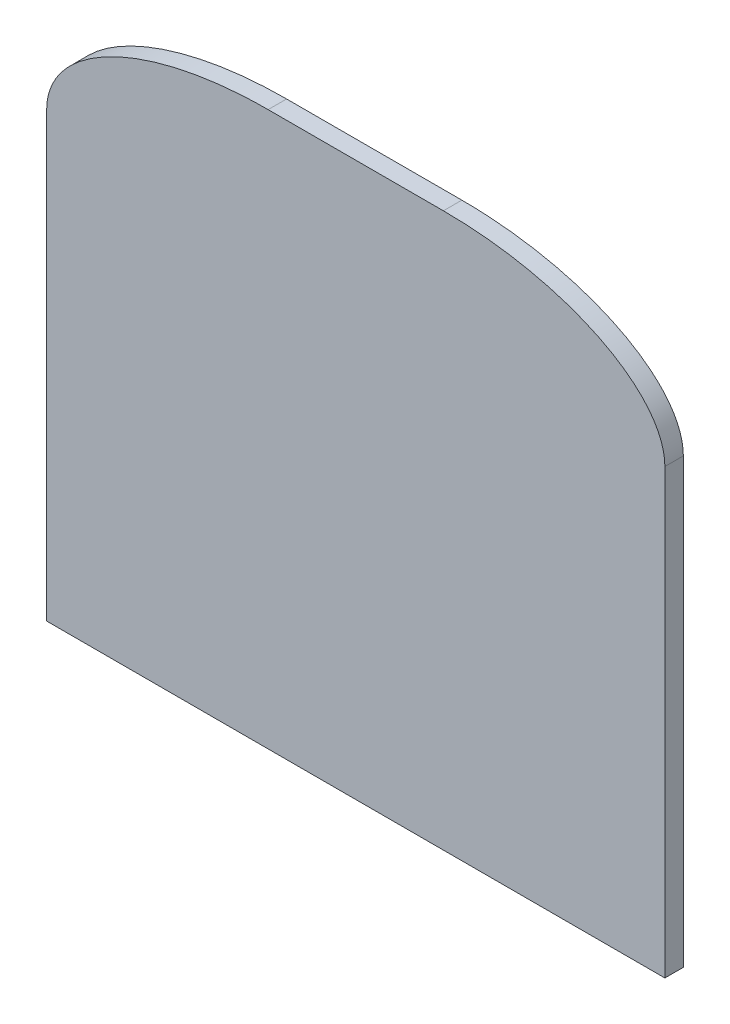
ISO-10303-21;
HEADER;
FILE_DESCRIPTION(('STEP AP214'),'2;1');
FILE_NAME('part.step','',(''),(''),'','','');
FILE_SCHEMA(('AUTOMOTIVE_DESIGN { 1 0 10303 214 1 1 1 1 }'));
ENDSEC;
DATA;
#1=APPLICATION_CONTEXT('core data for automotive mechanical design processes');
#2=APPLICATION_PROTOCOL_DEFINITION('international standard','automotive_design',2000,#1);
#3=PRODUCT_CONTEXT('',#1,'mechanical');
#4=PRODUCT('Part','Part','',(#3));
#5=PRODUCT_RELATED_PRODUCT_CATEGORY('part','',(#4));
#6=PRODUCT_DEFINITION_FORMATION('','',#4);
#7=PRODUCT_DEFINITION_CONTEXT('part definition',#1,'design');
#8=PRODUCT_DEFINITION('design','',#6,#7);
#9=PRODUCT_DEFINITION_SHAPE('','',#8);
#10=(LENGTH_UNIT() NAMED_UNIT(*) SI_UNIT(.MILLI.,.METRE.));
#11=(NAMED_UNIT(*) PLANE_ANGLE_UNIT() SI_UNIT($,.RADIAN.));
#12=(NAMED_UNIT(*) SI_UNIT($,.STERADIAN.) SOLID_ANGLE_UNIT());
#13=UNCERTAINTY_MEASURE_WITH_UNIT(LENGTH_MEASURE(1.E-05),#10,'distance_accuracy_value','');
#14=(GEOMETRIC_REPRESENTATION_CONTEXT(3) GLOBAL_UNCERTAINTY_ASSIGNED_CONTEXT((#13)) GLOBAL_UNIT_ASSIGNED_CONTEXT((#10,
#11,#12)) REPRESENTATION_CONTEXT('',''));
#15=CARTESIAN_POINT('',(0.,0.,0.));
#16=DIRECTION('',(0.,0.,1.));
#17=DIRECTION('',(1.,0.,0.));
#18=AXIS2_PLACEMENT_3D('',#15,#16,#17);
#19=CARTESIAN_POINT('',(-606.611607903014,22.225,12.7));
#20=DIRECTION('',(0.,0.,1.));
#21=DIRECTION('',(0.,-1.,0.));
#22=AXIS2_PLACEMENT_3D('',#19,#20,#21);
#23=PLANE('',#22);
#24=DIRECTION('',(0.,-1.,0.));
#25=VECTOR('',#24,1.);
#26=CARTESIAN_POINT('',(212.7,22.2249999999972,12.7));
#27=LINE('',#26,#25);
#28=CARTESIAN_POINT('',(212.699999999998,327.025000000001,12.7));
#29=VERTEX_POINT('',#28);
#30=CARTESIAN_POINT('',(212.7,22.225,12.7));
#31=VERTEX_POINT('',#30);
#32=EDGE_CURVE('E106',#29,#31,#27,.T.);
#33=ORIENTED_EDGE('',*,*,#32,.F.);
#34=CARTESIAN_POINT('',(60.2999999999979,403.225,12.7));
#35=CARTESIAN_POINT('',(212.699999999997,403.225,12.7));
#36=CARTESIAN_POINT('',(212.699999999998,327.025000000001,12.7));
#37=(BOUNDED_CURVE() B_SPLINE_CURVE(2,(#34,#35,#36),.UNSPECIFIED.,.F.,
.F.) B_SPLINE_CURVE_WITH_KNOTS((3,3),(0.,1.),
.UNSPECIFIED.) CURVE() GEOMETRIC_REPRESENTATION_ITEM() RATIONAL_B_SPLINE_CURVE((1.,
0.70710678118655,1.)) REPRESENTATION_ITEM(''));
#38=CARTESIAN_POINT('',(60.2999999999979,403.225,12.7));
#39=VERTEX_POINT('',#38);
#40=EDGE_CURVE('E177',#29,#39,#37,.F.);
#41=ORIENTED_EDGE('',*,*,#40,.T.);
#42=DIRECTION('',(1.,0.,0.));
#43=VECTOR('',#42,1.);
#44=CARTESIAN_POINT('',(-606.611607903014,403.225,12.7));
#45=LINE('',#44,#43);
#46=CARTESIAN_POINT('',(-60.3000000000021,403.225,12.7));
#47=VERTEX_POINT('',#46);
#48=EDGE_CURVE('E260',#47,#39,#45,.T.);
#49=ORIENTED_EDGE('',*,*,#48,.F.);
#50=CARTESIAN_POINT('',(-212.700000000002,327.024999999999,12.7));
#51=CARTESIAN_POINT('',(-212.700000000003,403.225,12.7));
#52=CARTESIAN_POINT('',(-60.3000000000021,403.225,12.7));
#53=(BOUNDED_CURVE() B_SPLINE_CURVE(2,(#50,#51,#52),.UNSPECIFIED.,.F.,
.F.) B_SPLINE_CURVE_WITH_KNOTS((3,3),(0.,1.),
.UNSPECIFIED.) CURVE() GEOMETRIC_REPRESENTATION_ITEM() RATIONAL_B_SPLINE_CURVE((1.,
0.707106781186545,1.)) REPRESENTATION_ITEM(''));
#54=CARTESIAN_POINT('',(-212.700000000002,327.024999999999,12.7));
#55=VERTEX_POINT('',#54);
#56=EDGE_CURVE('E246',#47,#55,#53,.F.);
#57=ORIENTED_EDGE('',*,*,#56,.T.);
#58=DIRECTION('',(0.,1.,0.));
#59=VECTOR('',#58,1.);
#60=CARTESIAN_POINT('',(-212.7,22.2250000000027,12.7));
#61=LINE('',#60,#59);
#62=CARTESIAN_POINT('',(-212.7,22.225,12.7));
#63=VERTEX_POINT('',#62);
#64=EDGE_CURVE('E121',#63,#55,#61,.T.);
#65=ORIENTED_EDGE('',*,*,#64,.F.);
#66=DIRECTION('',(1.,0.,0.));
#67=VECTOR('',#66,1.);
#68=CARTESIAN_POINT('',(-606.611607903014,22.225,12.7));
#69=LINE('',#68,#67);
#70=EDGE_CURVE('E119',#63,#31,#69,.T.);
#71=ORIENTED_EDGE('',*,*,#70,.T.);
#72=EDGE_LOOP('',(#33,#41,#49,#57,#65,#71));
#73=FACE_BOUND('',#72,.T.);
#74=ADVANCED_FACE('F42',(#73),#23,.T.);
#75=CARTESIAN_POINT('',(-606.611607903014,403.225,12.7));
#76=DIRECTION('',(0.,1.,0.));
#77=DIRECTION('',(0.,0.,1.));
#78=AXIS2_PLACEMENT_3D('',#75,#76,#77);
#79=PLANE('',#78);
#80=ORIENTED_EDGE('',*,*,#48,.T.);
#81=CARTESIAN_POINT('',(60.2999999999979,403.225,-0.634999999999997));
#82=CARTESIAN_POINT('',(60.2999999999979,403.225,4.02166666666667));
#83=CARTESIAN_POINT('',(60.2999999999979,403.225,8.67833333333338));
#84=CARTESIAN_POINT('',(60.2999999999979,403.225,13.335));
#85=(BOUNDED_CURVE() B_SPLINE_CURVE(3,(#81,#82,#83,#84),.UNSPECIFIED.,.F.,
.F.) B_SPLINE_CURVE_WITH_KNOTS((4,4),(-0.456008322441432,-0.442038322441432),
.UNSPECIFIED.) CURVE() GEOMETRIC_REPRESENTATION_ITEM() RATIONAL_B_SPLINE_CURVE((1.,1.,1.,1.)) REPRESENTATION_ITEM(''));
#86=CARTESIAN_POINT('',(60.2999999999979,403.225,0.));
#87=VERTEX_POINT('',#86);
#88=EDGE_CURVE('E71',#39,#87,#85,.F.);
#89=ORIENTED_EDGE('',*,*,#88,.T.);
#90=DIRECTION('',(1.,0.,0.));
#91=VECTOR('',#90,1.);
#92=CARTESIAN_POINT('',(-606.611607903014,403.225,0.));
#93=LINE('',#92,#91);
#94=CARTESIAN_POINT('',(-60.3000000000021,403.225,0.));
#95=VERTEX_POINT('',#94);
#96=EDGE_CURVE('E263',#95,#87,#93,.T.);
#97=ORIENTED_EDGE('',*,*,#96,.F.);
#98=CARTESIAN_POINT('',(-60.3000000000021,403.225,13.335));
#99=CARTESIAN_POINT('',(-60.3000000000021,403.225,8.67833333333338));
#100=CARTESIAN_POINT('',(-60.3000000000021,403.225,4.02166666666667));
#101=CARTESIAN_POINT('',(-60.3000000000021,403.225,-0.634999999999997));
#102=(BOUNDED_CURVE() B_SPLINE_CURVE(3,(#98,#99,#100,#101),.UNSPECIFIED.,.F.,
.F.) B_SPLINE_CURVE_WITH_KNOTS((4,4),(-0.456008322441432,-0.442038322441432),
.UNSPECIFIED.) CURVE() GEOMETRIC_REPRESENTATION_ITEM() RATIONAL_B_SPLINE_CURVE((1.,1.,1.,1.)) REPRESENTATION_ITEM(''));
#103=EDGE_CURVE('E254',#95,#47,#102,.F.);
#104=ORIENTED_EDGE('',*,*,#103,.T.);
#105=EDGE_LOOP('',(#80,#89,#97,#104));
#106=FACE_BOUND('',#105,.T.);
#107=ADVANCED_FACE('F161',(#106),#79,.T.);
#108=CARTESIAN_POINT('',(-606.611607903014,403.225,0.));
#109=DIRECTION('',(0.,0.,-1.));
#110=DIRECTION('',(0.,1.,0.));
#111=AXIS2_PLACEMENT_3D('',#108,#109,#110);
#112=PLANE('',#111);
#113=ORIENTED_EDGE('',*,*,#96,.T.);
#114=CARTESIAN_POINT('',(212.699999999998,327.025000000001,0.));
#115=CARTESIAN_POINT('',(212.699999999997,403.225,0.));
#116=CARTESIAN_POINT('',(60.2999999999979,403.225,0.));
#117=(BOUNDED_CURVE() B_SPLINE_CURVE(2,(#114,#115,#116),.UNSPECIFIED.,.F.,
.F.) B_SPLINE_CURVE_WITH_KNOTS((3,3),(0.,1.),
.UNSPECIFIED.) CURVE() GEOMETRIC_REPRESENTATION_ITEM() RATIONAL_B_SPLINE_CURVE((1.,
0.70710678118655,1.)) REPRESENTATION_ITEM(''));
#118=CARTESIAN_POINT('',(212.699999999998,327.025000000001,0.));
#119=VERTEX_POINT('',#118);
#120=EDGE_CURVE('E56',#87,#119,#117,.F.);
#121=ORIENTED_EDGE('',*,*,#120,.T.);
#122=DIRECTION('',(0.,1.,0.));
#123=VECTOR('',#122,1.);
#124=CARTESIAN_POINT('',(212.699999999997,403.224999999997,0.));
#125=LINE('',#124,#123);
#126=CARTESIAN_POINT('',(212.699999999999,22.225,0.));
#127=VERTEX_POINT('',#126);
#128=EDGE_CURVE('E125',#127,#119,#125,.T.);
#129=ORIENTED_EDGE('',*,*,#128,.F.);
#130=DIRECTION('',(1.,0.,0.));
#131=VECTOR('',#130,1.);
#132=CARTESIAN_POINT('',(-606.611607903014,22.225,0.));
#133=LINE('',#132,#131);
#134=CARTESIAN_POINT('',(-212.7,22.225,0.));
#135=VERTEX_POINT('',#134);
#136=EDGE_CURVE('E124',#135,#127,#133,.T.);
#137=ORIENTED_EDGE('',*,*,#136,.F.);
#138=DIRECTION('',(0.,-1.,0.));
#139=VECTOR('',#138,1.);
#140=CARTESIAN_POINT('',(-212.700000000003,403.225000000003,0.));
#141=LINE('',#140,#139);
#142=CARTESIAN_POINT('',(-212.700000000002,327.024999999999,0.));
#143=VERTEX_POINT('',#142);
#144=EDGE_CURVE('E259',#143,#135,#141,.T.);
#145=ORIENTED_EDGE('',*,*,#144,.F.);
#146=CARTESIAN_POINT('',(-60.3000000000021,403.225,0.));
#147=CARTESIAN_POINT('',(-212.700000000003,403.225,0.));
#148=CARTESIAN_POINT('',(-212.700000000002,327.024999999999,0.));
#149=(BOUNDED_CURVE() B_SPLINE_CURVE(2,(#146,#147,#148),.UNSPECIFIED.,.F.,
.F.) B_SPLINE_CURVE_WITH_KNOTS((3,3),(0.,1.),
.UNSPECIFIED.) CURVE() GEOMETRIC_REPRESENTATION_ITEM() RATIONAL_B_SPLINE_CURVE((1.,
0.707106781186545,1.)) REPRESENTATION_ITEM(''));
#150=EDGE_CURVE('E63',#143,#95,#149,.F.);
#151=ORIENTED_EDGE('',*,*,#150,.T.);
#152=EDGE_LOOP('',(#113,#121,#129,#137,#145,#151));
#153=FACE_BOUND('',#152,.T.);
#154=ADVANCED_FACE('F273',(#153),#112,.T.);
#155=CARTESIAN_POINT('',(-606.611607903014,22.225,0.));
#156=DIRECTION('',(0.,-1.,0.));
#157=DIRECTION('',(0.,0.,-1.));
#158=AXIS2_PLACEMENT_3D('',#155,#156,#157);
#159=PLANE('',#158);
#160=DIRECTION('',(0.,0.,1.));
#161=VECTOR('',#160,1.);
#162=CARTESIAN_POINT('',(-212.7,22.225,0.));
#163=LINE('',#162,#161);
#164=EDGE_CURVE('E140',#135,#63,#163,.T.);
#165=ORIENTED_EDGE('',*,*,#164,.F.);
#166=ORIENTED_EDGE('',*,*,#136,.T.);
#167=DIRECTION('',(0.,0.,-1.));
#168=VECTOR('',#167,1.);
#169=CARTESIAN_POINT('',(212.7,22.225,0.));
#170=LINE('',#169,#168);
#171=EDGE_CURVE('E111',#31,#127,#170,.T.);
#172=ORIENTED_EDGE('',*,*,#171,.F.);
#173=ORIENTED_EDGE('',*,*,#70,.F.);
#174=EDGE_LOOP('',(#165,#166,#172,#173));
#175=FACE_BOUND('',#174,.T.);
#176=ADVANCED_FACE('F127',(#175),#159,.T.);
#177=CARTESIAN_POINT('',(-212.7,0.,455.373322441432));
#178=DIRECTION('',(1.,0.,0.));
#179=DIRECTION('',(0.,0.,-1.));
#180=AXIS2_PLACEMENT_3D('',#177,#178,#179);
#181=PLANE('',#180);
#182=ORIENTED_EDGE('',*,*,#64,.T.);
#183=CARTESIAN_POINT('',(-212.700000000002,327.024999999999,-0.635000000000006));
#184=CARTESIAN_POINT('',(-212.700000000002,327.024999999999,4.02166666666666));
#185=CARTESIAN_POINT('',(-212.700000000002,327.024999999999,8.67833333333336));
#186=CARTESIAN_POINT('',(-212.700000000002,327.024999999999,13.335));
#187=(BOUNDED_CURVE() B_SPLINE_CURVE(3,(#183,#184,#185,#186),.UNSPECIFIED.,.F.,
.F.) B_SPLINE_CURVE_WITH_KNOTS((4,4),(-0.456008322441432,-0.442038322441432),
.UNSPECIFIED.) CURVE() GEOMETRIC_REPRESENTATION_ITEM() RATIONAL_B_SPLINE_CURVE((1.,1.,1.,1.)) REPRESENTATION_ITEM(''));
#188=EDGE_CURVE('E12',#55,#143,#187,.F.);
#189=ORIENTED_EDGE('',*,*,#188,.T.);
#190=ORIENTED_EDGE('',*,*,#144,.T.);
#191=ORIENTED_EDGE('',*,*,#164,.T.);
#192=EDGE_LOOP('',(#182,#189,#190,#191));
#193=FACE_BOUND('',#192,.T.);
#194=ADVANCED_FACE('F156',(#193),#181,.F.);
#195=CARTESIAN_POINT('',(212.7,1.39130744185866E-13,455.373322441432));
#196=DIRECTION('',(1.,0.,0.));
#197=DIRECTION('',(0.,0.,-1.));
#198=AXIS2_PLACEMENT_3D('',#195,#196,#197);
#199=PLANE('',#198);
#200=ORIENTED_EDGE('',*,*,#128,.T.);
#201=CARTESIAN_POINT('',(212.699999999998,327.025000000001,13.3350000000001));
#202=CARTESIAN_POINT('',(212.699999999998,327.025000000001,8.67833333333336));
#203=CARTESIAN_POINT('',(212.699999999998,327.025000000001,4.0216666666667));
#204=CARTESIAN_POINT('',(212.699999999998,327.025000000001,-0.634999999999987));
#205=(BOUNDED_CURVE() B_SPLINE_CURVE(3,(#201,#202,#203,#204),.UNSPECIFIED.,.F.,
.F.) B_SPLINE_CURVE_WITH_KNOTS((4,4),(-0.456008322441432,-0.442038322441432),
.UNSPECIFIED.) CURVE() GEOMETRIC_REPRESENTATION_ITEM() RATIONAL_B_SPLINE_CURVE((1.,1.,1.,1.)) REPRESENTATION_ITEM(''));
#206=EDGE_CURVE('E113',#119,#29,#205,.F.);
#207=ORIENTED_EDGE('',*,*,#206,.T.);
#208=ORIENTED_EDGE('',*,*,#32,.T.);
#209=ORIENTED_EDGE('',*,*,#171,.T.);
#210=EDGE_LOOP('',(#200,#207,#208,#209));
#211=FACE_BOUND('',#210,.T.);
#212=ADVANCED_FACE('F109',(#211),#199,.T.);
#213=CARTESIAN_POINT('',(212.699999999998,327.025000000001,-0.634999999999987));
#214=CARTESIAN_POINT('',(212.699999999998,327.025000000001,4.0216666666667));
#215=CARTESIAN_POINT('',(212.699999999998,327.025000000001,8.67833333333336));
#216=CARTESIAN_POINT('',(212.699999999998,327.025000000001,13.3350000000001));
#217=CARTESIAN_POINT('',(212.699999999997,403.225,-0.634999999999987));
#218=CARTESIAN_POINT('',(212.699999999997,403.225,4.02166666666669));
#219=CARTESIAN_POINT('',(212.699999999997,403.225,8.67833333333338));
#220=CARTESIAN_POINT('',(212.699999999997,403.225,13.3350000000001));
#221=CARTESIAN_POINT('',(60.2999999999979,403.225,-0.634999999999997));
#222=CARTESIAN_POINT('',(60.2999999999979,403.225,4.02166666666667));
#223=CARTESIAN_POINT('',(60.2999999999979,403.225,8.67833333333338));
#224=CARTESIAN_POINT('',(60.2999999999979,403.225,13.335));
#225=(BOUNDED_SURFACE() B_SPLINE_SURFACE(2,3,((#213,#214,#215,#216),(#217,#218,#219,#220),(#221,
#222,#223,#224)),.UNSPECIFIED.,.F.,.F.,.F.) B_SPLINE_SURFACE_WITH_KNOTS((3,3),(4,4),(0.,1.),
(-0.456008322441432,-0.442038322441432),
.UNSPECIFIED.) GEOMETRIC_REPRESENTATION_ITEM() RATIONAL_B_SPLINE_SURFACE(((1.,1.,1.,1.),
(0.70710678118655,0.70710678118655,0.70710678118655,0.70710678118655),(1.,1.,1.,1.))) REPRESENTATION_ITEM('') SURFACE());
#226=ORIENTED_EDGE('',*,*,#120,.F.);
#227=ORIENTED_EDGE('',*,*,#88,.F.);
#228=ORIENTED_EDGE('',*,*,#40,.F.);
#229=ORIENTED_EDGE('',*,*,#206,.F.);
#230=EDGE_LOOP('',(#226,#227,#228,#229));
#231=FACE_BOUND('',#230,.T.);
#232=ADVANCED_FACE('F155',(#231),#225,.T.);
#233=CARTESIAN_POINT('',(-60.3000000000021,403.225,-0.634999999999997));
#234=CARTESIAN_POINT('',(-60.3000000000021,403.225,4.02166666666667));
#235=CARTESIAN_POINT('',(-60.3000000000021,403.225,8.67833333333338));
#236=CARTESIAN_POINT('',(-60.3000000000021,403.225,13.335));
#237=CARTESIAN_POINT('',(-212.700000000003,403.225,-0.635000000000006));
#238=CARTESIAN_POINT('',(-212.700000000003,403.225,4.02166666666667));
#239=CARTESIAN_POINT('',(-212.700000000003,403.225,8.67833333333335));
#240=CARTESIAN_POINT('',(-212.700000000003,403.225,13.335));
#241=CARTESIAN_POINT('',(-212.700000000002,327.024999999999,-0.635000000000006));
#242=CARTESIAN_POINT('',(-212.700000000002,327.024999999999,4.02166666666666));
#243=CARTESIAN_POINT('',(-212.700000000002,327.024999999999,8.67833333333336));
#244=CARTESIAN_POINT('',(-212.700000000002,327.024999999999,13.335));
#245=(BOUNDED_SURFACE() B_SPLINE_SURFACE(2,3,((#233,#234,#235,#236),(#237,#238,#239,#240),(#241,
#242,#243,#244)),.UNSPECIFIED.,.F.,.F.,.F.) B_SPLINE_SURFACE_WITH_KNOTS((3,3),(4,4),(0.,1.),
(-0.456008322441432,-0.442038322441432),
.UNSPECIFIED.) GEOMETRIC_REPRESENTATION_ITEM() RATIONAL_B_SPLINE_SURFACE(((1.,1.,1.,1.),
(0.707106781186545,0.707106781186545,0.707106781186545,0.707106781186545),(1.,1.,1.,1.))) REPRESENTATION_ITEM('') SURFACE());
#246=ORIENTED_EDGE('',*,*,#56,.F.);
#247=ORIENTED_EDGE('',*,*,#103,.F.);
#248=ORIENTED_EDGE('',*,*,#150,.F.);
#249=ORIENTED_EDGE('',*,*,#188,.F.);
#250=EDGE_LOOP('',(#246,#247,#248,#249));
#251=FACE_BOUND('',#250,.T.);
#252=ADVANCED_FACE('F45',(#251),#245,.T.);
#253=CLOSED_SHELL('',(#74,#107,#154,#176,#194,#212,#232,#252));
#254=MANIFOLD_SOLID_BREP('B2',#253);
#255=ADVANCED_BREP_SHAPE_REPRESENTATION('',(#18,#254),#14);
#256=SHAPE_DEFINITION_REPRESENTATION(#9,#255);
ENDSEC;
END-ISO-10303-21;
